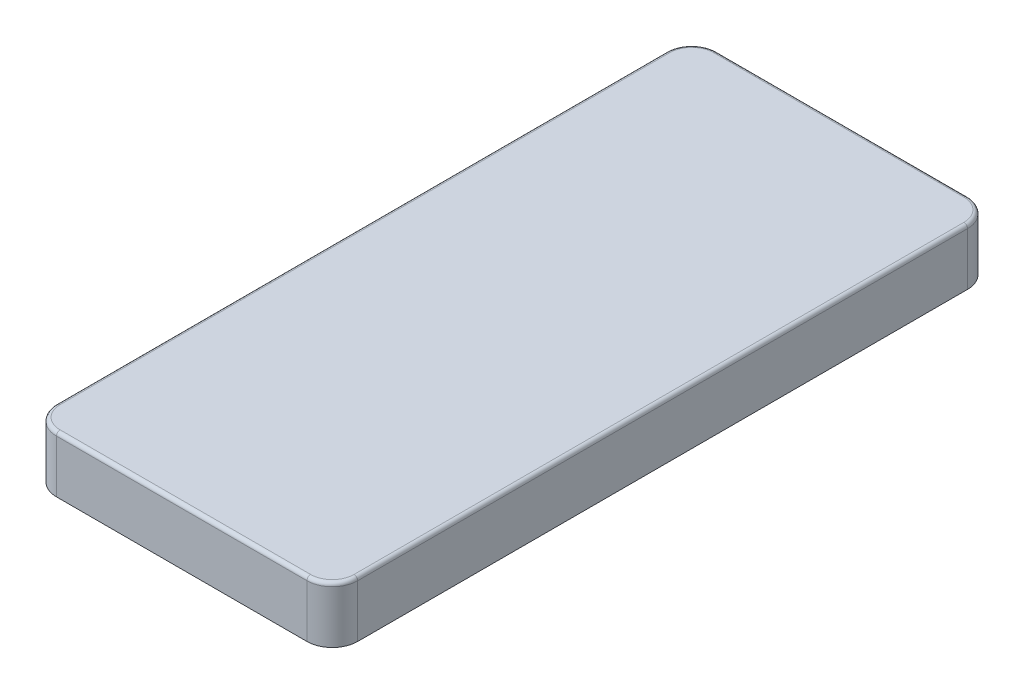
ISO-10303-21;
HEADER;
FILE_DESCRIPTION(('STEP AP214'),'2;1');
FILE_NAME('part.step','',(''),(''),'','','');
FILE_SCHEMA(('AUTOMOTIVE_DESIGN { 1 0 10303 214 1 1 1 1 }'));
ENDSEC;
DATA;
#1=APPLICATION_CONTEXT('core data for automotive mechanical design processes');
#2=APPLICATION_PROTOCOL_DEFINITION('international standard','automotive_design',2000,#1);
#3=PRODUCT_CONTEXT('',#1,'mechanical');
#4=PRODUCT('Part','Part','',(#3));
#5=PRODUCT_RELATED_PRODUCT_CATEGORY('part','',(#4));
#6=PRODUCT_DEFINITION_FORMATION('','',#4);
#7=PRODUCT_DEFINITION_CONTEXT('part definition',#1,'design');
#8=PRODUCT_DEFINITION('design','',#6,#7);
#9=PRODUCT_DEFINITION_SHAPE('','',#8);
#10=(LENGTH_UNIT() NAMED_UNIT(*) SI_UNIT(.MILLI.,.METRE.));
#11=(NAMED_UNIT(*) PLANE_ANGLE_UNIT() SI_UNIT($,.RADIAN.));
#12=(NAMED_UNIT(*) SI_UNIT($,.STERADIAN.) SOLID_ANGLE_UNIT());
#13=UNCERTAINTY_MEASURE_WITH_UNIT(LENGTH_MEASURE(1.E-05),#10,'distance_accuracy_value','');
#14=(GEOMETRIC_REPRESENTATION_CONTEXT(3) GLOBAL_UNCERTAINTY_ASSIGNED_CONTEXT((#13)) GLOBAL_UNIT_ASSIGNED_CONTEXT((#10,
#11,#12)) REPRESENTATION_CONTEXT('',''));
#15=CARTESIAN_POINT('',(0.,0.,0.));
#16=DIRECTION('',(0.,0.,1.));
#17=DIRECTION('',(1.,0.,0.));
#18=AXIS2_PLACEMENT_3D('',#15,#16,#17);
#19=CARTESIAN_POINT('',(-7.,15.5,-7.));
#20=DIRECTION('',(0.,-1.,0.));
#21=DIRECTION('',(0.,0.,-1.));
#22=AXIS2_PLACEMENT_3D('',#19,#20,#21);
#23=CYLINDRICAL_SURFACE('',#22,7.);
#24=DIRECTION('',(0.,-1.,0.));
#25=VECTOR('',#24,1.);
#26=CARTESIAN_POINT('',(0.,15.5,-7.00000000000005));
#27=LINE('',#26,#25);
#28=CARTESIAN_POINT('',(0.,14.5,-7.00000000000005));
#29=VERTEX_POINT('',#28);
#30=CARTESIAN_POINT('',(0.,0.,-7.00000000000005));
#31=VERTEX_POINT('',#30);
#32=EDGE_CURVE('E325',#29,#31,#27,.T.);
#33=ORIENTED_EDGE('',*,*,#32,.F.);
#34=CARTESIAN_POINT('',(-7.,14.5,-7.));
#35=DIRECTION('',(0.,1.,0.));
#36=DIRECTION('',(0.,0.,1.));
#37=AXIS2_PLACEMENT_3D('',#34,#35,#36);
#38=CIRCLE('',#37,7.);
#39=CARTESIAN_POINT('',(-7.00000000000005,14.5,0.));
#40=VERTEX_POINT('',#39);
#41=EDGE_CURVE('E353',#29,#40,#38,.F.);
#42=ORIENTED_EDGE('',*,*,#41,.T.);
#43=DIRECTION('',(0.,-1.,0.));
#44=VECTOR('',#43,1.);
#45=CARTESIAN_POINT('',(-7.00000000000005,15.5,0.));
#46=LINE('',#45,#44);
#47=CARTESIAN_POINT('',(-7.00000000000005,0.,0.));
#48=VERTEX_POINT('',#47);
#49=EDGE_CURVE('E304',#40,#48,#46,.T.);
#50=ORIENTED_EDGE('',*,*,#49,.T.);
#51=CARTESIAN_POINT('',(-7.,0.,-7.));
#52=DIRECTION('',(0.,1.,0.));
#53=DIRECTION('',(0.,0.,1.));
#54=AXIS2_PLACEMENT_3D('',#51,#52,#53);
#55=CIRCLE('',#54,7.);
#56=EDGE_CURVE('E205',#48,#31,#55,.T.);
#57=ORIENTED_EDGE('',*,*,#56,.T.);
#58=EDGE_LOOP('',(#33,#42,#50,#57));
#59=FACE_BOUND('',#58,.T.);
#60=ADVANCED_FACE('F38',(#59),#23,.T.);
#61=CARTESIAN_POINT('',(0.,15.5,-7.00000000000005));
#62=DIRECTION('',(-1.,0.,0.));
#63=DIRECTION('',(0.,0.,1.));
#64=AXIS2_PLACEMENT_3D('',#61,#62,#63);
#65=PLANE('',#64);
#66=DIRECTION('',(0.,-1.,0.));
#67=VECTOR('',#66,1.);
#68=CARTESIAN_POINT('',(0.,15.5,-175.));
#69=LINE('',#68,#67);
#70=CARTESIAN_POINT('',(0.,14.5,-175.));
#71=VERTEX_POINT('',#70);
#72=CARTESIAN_POINT('',(0.,0.,-175.));
#73=VERTEX_POINT('',#72);
#74=EDGE_CURVE('E322',#71,#73,#69,.T.);
#75=ORIENTED_EDGE('',*,*,#74,.F.);
#76=DIRECTION('',(0.,0.,-1.));
#77=VECTOR('',#76,1.);
#78=CARTESIAN_POINT('',(0.,14.5,-7.00000000000005));
#79=LINE('',#78,#77);
#80=EDGE_CURVE('E11',#71,#29,#79,.F.);
#81=ORIENTED_EDGE('',*,*,#80,.T.);
#82=ORIENTED_EDGE('',*,*,#32,.T.);
#83=DIRECTION('',(0.,0.,-1.));
#84=VECTOR('',#83,1.);
#85=CARTESIAN_POINT('',(0.,0.,-7.00000000000005));
#86=LINE('',#85,#84);
#87=EDGE_CURVE('E211',#31,#73,#86,.T.);
#88=ORIENTED_EDGE('',*,*,#87,.T.);
#89=EDGE_LOOP('',(#75,#81,#82,#88));
#90=FACE_BOUND('',#89,.T.);
#91=ADVANCED_FACE('F456',(#90),#65,.F.);
#92=CARTESIAN_POINT('',(-7.,15.5,-175.));
#93=DIRECTION('',(0.,-1.,0.));
#94=DIRECTION('',(0.,0.,-1.));
#95=AXIS2_PLACEMENT_3D('',#92,#93,#94);
#96=CYLINDRICAL_SURFACE('',#95,7.);
#97=DIRECTION('',(0.,-1.,0.));
#98=VECTOR('',#97,1.);
#99=CARTESIAN_POINT('',(-7.00000000000005,15.5,-182.));
#100=LINE('',#99,#98);
#101=CARTESIAN_POINT('',(-7.00000000000005,14.5,-182.));
#102=VERTEX_POINT('',#101);
#103=CARTESIAN_POINT('',(-7.00000000000005,0.,-182.));
#104=VERTEX_POINT('',#103);
#105=EDGE_CURVE('E319',#102,#104,#100,.T.);
#106=ORIENTED_EDGE('',*,*,#105,.F.);
#107=CARTESIAN_POINT('',(-7.,14.5,-175.));
#108=DIRECTION('',(0.,1.,0.));
#109=DIRECTION('',(0.,0.,1.));
#110=AXIS2_PLACEMENT_3D('',#107,#108,#109);
#111=CIRCLE('',#110,7.);
#112=EDGE_CURVE('E48',#102,#71,#111,.F.);
#113=ORIENTED_EDGE('',*,*,#112,.T.);
#114=ORIENTED_EDGE('',*,*,#74,.T.);
#115=CARTESIAN_POINT('',(-7.,0.,-175.));
#116=DIRECTION('',(0.,1.,0.));
#117=DIRECTION('',(0.,0.,1.));
#118=AXIS2_PLACEMENT_3D('',#115,#116,#117);
#119=CIRCLE('',#118,7.);
#120=EDGE_CURVE('E280',#73,#104,#119,.T.);
#121=ORIENTED_EDGE('',*,*,#120,.T.);
#122=EDGE_LOOP('',(#106,#113,#114,#121));
#123=FACE_BOUND('',#122,.T.);
#124=ADVANCED_FACE('F475',(#123),#96,.T.);
#125=CARTESIAN_POINT('',(-7.00000000000005,15.5,-182.));
#126=DIRECTION('',(0.,0.,1.));
#127=DIRECTION('',(1.,0.,0.));
#128=AXIS2_PLACEMENT_3D('',#125,#126,#127);
#129=PLANE('',#128);
#130=DIRECTION('',(0.,-1.,0.));
#131=VECTOR('',#130,1.);
#132=CARTESIAN_POINT('',(-76.,15.5,-182.));
#133=LINE('',#132,#131);
#134=CARTESIAN_POINT('',(-76.,14.5,-182.));
#135=VERTEX_POINT('',#134);
#136=CARTESIAN_POINT('',(-76.,0.,-182.));
#137=VERTEX_POINT('',#136);
#138=EDGE_CURVE('E316',#135,#137,#133,.T.);
#139=ORIENTED_EDGE('',*,*,#138,.F.);
#140=DIRECTION('',(-1.,0.,0.));
#141=VECTOR('',#140,1.);
#142=CARTESIAN_POINT('',(-7.00000000000005,14.5,-182.));
#143=LINE('',#142,#141);
#144=EDGE_CURVE('E63',#135,#102,#143,.F.);
#145=ORIENTED_EDGE('',*,*,#144,.T.);
#146=ORIENTED_EDGE('',*,*,#105,.T.);
#147=DIRECTION('',(-1.,0.,0.));
#148=VECTOR('',#147,1.);
#149=CARTESIAN_POINT('',(-7.00000000000005,0.,-182.));
#150=LINE('',#149,#148);
#151=EDGE_CURVE('E284',#104,#137,#150,.T.);
#152=ORIENTED_EDGE('',*,*,#151,.T.);
#153=EDGE_LOOP('',(#139,#145,#146,#152));
#154=FACE_BOUND('',#153,.T.);
#155=ADVANCED_FACE('F414',(#154),#129,.F.);
#156=CARTESIAN_POINT('',(-76.,15.5,-175.));
#157=DIRECTION('',(0.,-1.,0.));
#158=DIRECTION('',(0.,0.,-1.));
#159=AXIS2_PLACEMENT_3D('',#156,#157,#158);
#160=CYLINDRICAL_SURFACE('',#159,7.00000000000001);
#161=DIRECTION('',(0.,-1.,0.));
#162=VECTOR('',#161,1.);
#163=CARTESIAN_POINT('',(-83.,15.5,-175.));
#164=LINE('',#163,#162);
#165=CARTESIAN_POINT('',(-83.,14.5,-175.));
#166=VERTEX_POINT('',#165);
#167=CARTESIAN_POINT('',(-83.,0.,-175.));
#168=VERTEX_POINT('',#167);
#169=EDGE_CURVE('E313',#166,#168,#164,.T.);
#170=ORIENTED_EDGE('',*,*,#169,.F.);
#171=CARTESIAN_POINT('',(-76.,14.5,-175.));
#172=DIRECTION('',(0.,1.,0.));
#173=DIRECTION('',(0.,0.,1.));
#174=AXIS2_PLACEMENT_3D('',#171,#172,#173);
#175=CIRCLE('',#174,7.00000000000001);
#176=EDGE_CURVE('E366',#166,#135,#175,.F.);
#177=ORIENTED_EDGE('',*,*,#176,.T.);
#178=ORIENTED_EDGE('',*,*,#138,.T.);
#179=CARTESIAN_POINT('',(-76.,0.,-175.));
#180=DIRECTION('',(0.,1.,0.));
#181=DIRECTION('',(0.,0.,1.));
#182=AXIS2_PLACEMENT_3D('',#179,#180,#181);
#183=CIRCLE('',#182,7.00000000000001);
#184=EDGE_CURVE('E288',#137,#168,#183,.T.);
#185=ORIENTED_EDGE('',*,*,#184,.T.);
#186=EDGE_LOOP('',(#170,#177,#178,#185));
#187=FACE_BOUND('',#186,.T.);
#188=ADVANCED_FACE('F413',(#187),#160,.T.);
#189=CARTESIAN_POINT('',(-83.,15.5,-7.00000000000004));
#190=DIRECTION('',(1.,0.,0.));
#191=DIRECTION('',(0.,0.,-1.));
#192=AXIS2_PLACEMENT_3D('',#189,#190,#191);
#193=PLANE('',#192);
#194=DIRECTION('',(0.,-1.,0.));
#195=VECTOR('',#194,1.);
#196=CARTESIAN_POINT('',(-83.,15.5,-7.00000000000004));
#197=LINE('',#196,#195);
#198=CARTESIAN_POINT('',(-83.,14.5,-7.00000000000004));
#199=VERTEX_POINT('',#198);
#200=CARTESIAN_POINT('',(-83.,0.,-7.00000000000004));
#201=VERTEX_POINT('',#200);
#202=EDGE_CURVE('E310',#199,#201,#197,.T.);
#203=ORIENTED_EDGE('',*,*,#202,.F.);
#204=DIRECTION('',(0.,0.,1.));
#205=VECTOR('',#204,1.);
#206=CARTESIAN_POINT('',(-83.,14.5,-175.));
#207=LINE('',#206,#205);
#208=EDGE_CURVE('E363',#199,#166,#207,.F.);
#209=ORIENTED_EDGE('',*,*,#208,.T.);
#210=ORIENTED_EDGE('',*,*,#169,.T.);
#211=DIRECTION('',(0.,0.,1.));
#212=VECTOR('',#211,1.);
#213=CARTESIAN_POINT('',(-83.,0.,-7.00000000000004));
#214=LINE('',#213,#212);
#215=EDGE_CURVE('E292',#168,#201,#214,.T.);
#216=ORIENTED_EDGE('',*,*,#215,.T.);
#217=EDGE_LOOP('',(#203,#209,#210,#216));
#218=FACE_BOUND('',#217,.T.);
#219=ADVANCED_FACE('F426',(#218),#193,.F.);
#220=CARTESIAN_POINT('',(-76.,15.5,-6.99999999999999));
#221=DIRECTION('',(0.,-1.,0.));
#222=DIRECTION('',(0.,0.,-1.));
#223=AXIS2_PLACEMENT_3D('',#220,#221,#222);
#224=CYLINDRICAL_SURFACE('',#223,7.);
#225=DIRECTION('',(0.,-1.,0.));
#226=VECTOR('',#225,1.);
#227=CARTESIAN_POINT('',(-76.,15.5,0.));
#228=LINE('',#227,#226);
#229=CARTESIAN_POINT('',(-76.,14.5,0.));
#230=VERTEX_POINT('',#229);
#231=CARTESIAN_POINT('',(-76.,0.,0.));
#232=VERTEX_POINT('',#231);
#233=EDGE_CURVE('E307',#230,#232,#228,.T.);
#234=ORIENTED_EDGE('',*,*,#233,.F.);
#235=CARTESIAN_POINT('',(-76.,14.5,-6.99999999999999));
#236=DIRECTION('',(0.,1.,0.));
#237=DIRECTION('',(0.,0.,1.));
#238=AXIS2_PLACEMENT_3D('',#235,#236,#237);
#239=CIRCLE('',#238,7.);
#240=EDGE_CURVE('E360',#230,#199,#239,.F.);
#241=ORIENTED_EDGE('',*,*,#240,.T.);
#242=ORIENTED_EDGE('',*,*,#202,.T.);
#243=CARTESIAN_POINT('',(-76.,0.,-6.99999999999999));
#244=DIRECTION('',(0.,1.,0.));
#245=DIRECTION('',(0.,0.,-1.));
#246=AXIS2_PLACEMENT_3D('',#243,#244,#245);
#247=CIRCLE('',#246,7.);
#248=EDGE_CURVE('E296',#201,#232,#247,.T.);
#249=ORIENTED_EDGE('',*,*,#248,.T.);
#250=EDGE_LOOP('',(#234,#241,#242,#249));
#251=FACE_BOUND('',#250,.T.);
#252=ADVANCED_FACE('F429',(#251),#224,.T.);
#253=CARTESIAN_POINT('',(-7.00000000000005,15.5,0.));
#254=DIRECTION('',(0.,0.,-1.));
#255=DIRECTION('',(-1.,0.,0.));
#256=AXIS2_PLACEMENT_3D('',#253,#254,#255);
#257=PLANE('',#256);
#258=ORIENTED_EDGE('',*,*,#49,.F.);
#259=DIRECTION('',(1.,0.,0.));
#260=VECTOR('',#259,1.);
#261=CARTESIAN_POINT('',(-76.,14.5,0.));
#262=LINE('',#261,#260);
#263=EDGE_CURVE('E357',#40,#230,#262,.F.);
#264=ORIENTED_EDGE('',*,*,#263,.T.);
#265=ORIENTED_EDGE('',*,*,#233,.T.);
#266=DIRECTION('',(1.,0.,0.));
#267=VECTOR('',#266,1.);
#268=CARTESIAN_POINT('',(-7.00000000000005,0.,0.));
#269=LINE('',#268,#267);
#270=EDGE_CURVE('E300',#232,#48,#269,.T.);
#271=ORIENTED_EDGE('',*,*,#270,.T.);
#272=EDGE_LOOP('',(#258,#264,#265,#271));
#273=FACE_BOUND('',#272,.T.);
#274=ADVANCED_FACE('F488',(#273),#257,.F.);
#275=CARTESIAN_POINT('',(-7.,15.5,-7.));
#276=DIRECTION('',(0.,1.,0.));
#277=DIRECTION('',(0.,0.,1.));
#278=AXIS2_PLACEMENT_3D('',#275,#276,#277);
#279=PLANE('',#278);
#280=DIRECTION('',(1.,0.,0.));
#281=VECTOR('',#280,1.);
#282=CARTESIAN_POINT('',(-7.00000000000005,15.5,-0.999999999999999));
#283=LINE('',#282,#281);
#284=CARTESIAN_POINT('',(-76.,15.5,-0.999999999999994));
#285=VERTEX_POINT('',#284);
#286=CARTESIAN_POINT('',(-7.00000000000004,15.5,-0.999999999999999));
#287=VERTEX_POINT('',#286);
#288=EDGE_CURVE('E346',#285,#287,#283,.T.);
#289=ORIENTED_EDGE('',*,*,#288,.T.);
#290=CARTESIAN_POINT('',(-7.,15.5,-7.));
#291=DIRECTION('',(0.,1.,0.));
#292=DIRECTION('',(0.,0.,1.));
#293=AXIS2_PLACEMENT_3D('',#290,#291,#292);
#294=CIRCLE('',#293,6.);
#295=CARTESIAN_POINT('',(-1.,15.5,-7.00000000000004));
#296=VERTEX_POINT('',#295);
#297=EDGE_CURVE('E349',#287,#296,#294,.T.);
#298=ORIENTED_EDGE('',*,*,#297,.T.);
#299=DIRECTION('',(0.,0.,-1.));
#300=VECTOR('',#299,1.);
#301=CARTESIAN_POINT('',(-1.,15.5,-175.));
#302=LINE('',#301,#300);
#303=CARTESIAN_POINT('',(-1.,15.5,-175.));
#304=VERTEX_POINT('',#303);
#305=EDGE_CURVE('E328',#296,#304,#302,.T.);
#306=ORIENTED_EDGE('',*,*,#305,.T.);
#307=CARTESIAN_POINT('',(-7.,15.5,-175.));
#308=DIRECTION('',(0.,1.,0.));
#309=DIRECTION('',(0.,0.,1.));
#310=AXIS2_PLACEMENT_3D('',#307,#308,#309);
#311=CIRCLE('',#310,6.);
#312=CARTESIAN_POINT('',(-7.00000000000005,15.5,-181.));
#313=VERTEX_POINT('',#312);
#314=EDGE_CURVE('E331',#304,#313,#311,.T.);
#315=ORIENTED_EDGE('',*,*,#314,.T.);
#316=DIRECTION('',(-1.,0.,0.));
#317=VECTOR('',#316,1.);
#318=CARTESIAN_POINT('',(-76.,15.5,-181.));
#319=LINE('',#318,#317);
#320=CARTESIAN_POINT('',(-76.,15.5,-181.));
#321=VERTEX_POINT('',#320);
#322=EDGE_CURVE('E334',#313,#321,#319,.T.);
#323=ORIENTED_EDGE('',*,*,#322,.T.);
#324=CARTESIAN_POINT('',(-76.,15.5,-175.));
#325=DIRECTION('',(0.,1.,0.));
#326=DIRECTION('',(0.,0.,1.));
#327=AXIS2_PLACEMENT_3D('',#324,#325,#326);
#328=CIRCLE('',#327,6.00000000000001);
#329=CARTESIAN_POINT('',(-82.,15.5,-175.));
#330=VERTEX_POINT('',#329);
#331=EDGE_CURVE('E337',#321,#330,#328,.T.);
#332=ORIENTED_EDGE('',*,*,#331,.T.);
#333=DIRECTION('',(0.,0.,1.));
#334=VECTOR('',#333,1.);
#335=CARTESIAN_POINT('',(-82.,15.5,-7.00000000000004));
#336=LINE('',#335,#334);
#337=CARTESIAN_POINT('',(-82.,15.5,-7.00000000000003));
#338=VERTEX_POINT('',#337);
#339=EDGE_CURVE('E340',#330,#338,#336,.T.);
#340=ORIENTED_EDGE('',*,*,#339,.T.);
#341=CARTESIAN_POINT('',(-76.,15.5,-6.99999999999999));
#342=DIRECTION('',(0.,1.,0.));
#343=DIRECTION('',(0.,0.,1.));
#344=AXIS2_PLACEMENT_3D('',#341,#342,#343);
#345=CIRCLE('',#344,6.);
#346=EDGE_CURVE('E343',#338,#285,#345,.T.);
#347=ORIENTED_EDGE('',*,*,#346,.T.);
#348=EDGE_LOOP('',(#289,#298,#306,#315,#323,#332,#340,#347));
#349=FACE_BOUND('',#348,.T.);
#350=ADVANCED_FACE('F442',(#349),#279,.T.);
#351=CARTESIAN_POINT('',(-7.,0.,-7.));
#352=DIRECTION('',(0.,1.,0.));
#353=DIRECTION('',(0.,0.,1.));
#354=AXIS2_PLACEMENT_3D('',#351,#352,#353);
#355=PLANE('',#354);
#356=DIRECTION('',(1.,0.,0.));
#357=VECTOR('',#356,1.);
#358=CARTESIAN_POINT('',(-7.00000000000005,0.,-2.));
#359=LINE('',#358,#357);
#360=CARTESIAN_POINT('',(-76.,0.,-1.99999999999999));
#361=VERTEX_POINT('',#360);
#362=CARTESIAN_POINT('',(-7.00000000000005,0.,-2.));
#363=VERTEX_POINT('',#362);
#364=EDGE_CURVE('E199',#361,#363,#359,.T.);
#365=ORIENTED_EDGE('',*,*,#364,.T.);
#366=CARTESIAN_POINT('',(-7.,0.,-7.));
#367=DIRECTION('',(0.,1.,0.));
#368=DIRECTION('',(0.,0.,1.));
#369=AXIS2_PLACEMENT_3D('',#366,#367,#368);
#370=CIRCLE('',#369,5.);
#371=CARTESIAN_POINT('',(-2.,0.,-7.00000000000005));
#372=VERTEX_POINT('',#371);
#373=EDGE_CURVE('E249',#363,#372,#370,.T.);
#374=ORIENTED_EDGE('',*,*,#373,.T.);
#375=DIRECTION('',(0.,0.,-1.));
#376=VECTOR('',#375,1.);
#377=CARTESIAN_POINT('',(-2.,0.,-7.00000000000005));
#378=LINE('',#377,#376);
#379=CARTESIAN_POINT('',(-2.,0.,-175.));
#380=VERTEX_POINT('',#379);
#381=EDGE_CURVE('E203',#372,#380,#378,.T.);
#382=ORIENTED_EDGE('',*,*,#381,.T.);
#383=CARTESIAN_POINT('',(-7.,0.,-175.));
#384=DIRECTION('',(0.,1.,0.));
#385=DIRECTION('',(0.,0.,1.));
#386=AXIS2_PLACEMENT_3D('',#383,#384,#385);
#387=CIRCLE('',#386,5.);
#388=CARTESIAN_POINT('',(-7.00000000000003,0.,-180.));
#389=VERTEX_POINT('',#388);
#390=EDGE_CURVE('E271',#380,#389,#387,.T.);
#391=ORIENTED_EDGE('',*,*,#390,.T.);
#392=DIRECTION('',(-1.,0.,0.));
#393=VECTOR('',#392,1.);
#394=CARTESIAN_POINT('',(-7.00000000000005,0.,-180.));
#395=LINE('',#394,#393);
#396=CARTESIAN_POINT('',(-76.,0.,-180.));
#397=VERTEX_POINT('',#396);
#398=EDGE_CURVE('E267',#389,#397,#395,.T.);
#399=ORIENTED_EDGE('',*,*,#398,.T.);
#400=CARTESIAN_POINT('',(-76.,0.,-175.));
#401=DIRECTION('',(0.,1.,0.));
#402=DIRECTION('',(0.,0.,1.));
#403=AXIS2_PLACEMENT_3D('',#400,#401,#402);
#404=CIRCLE('',#403,5.00000000000001);
#405=CARTESIAN_POINT('',(-81.,0.,-175.));
#406=VERTEX_POINT('',#405);
#407=EDGE_CURVE('E263',#397,#406,#404,.T.);
#408=ORIENTED_EDGE('',*,*,#407,.T.);
#409=DIRECTION('',(0.,0.,1.));
#410=VECTOR('',#409,1.);
#411=CARTESIAN_POINT('',(-81.,0.,-7.00000000000004));
#412=LINE('',#411,#410);
#413=CARTESIAN_POINT('',(-81.,0.,-7.00000000000004));
#414=VERTEX_POINT('',#413);
#415=EDGE_CURVE('E259',#406,#414,#412,.T.);
#416=ORIENTED_EDGE('',*,*,#415,.T.);
#417=CARTESIAN_POINT('',(-76.,0.,-6.99999999999999));
#418=DIRECTION('',(0.,1.,0.));
#419=DIRECTION('',(0.,0.,1.));
#420=AXIS2_PLACEMENT_3D('',#417,#418,#419);
#421=CIRCLE('',#420,5.);
#422=EDGE_CURVE('E255',#414,#361,#421,.T.);
#423=ORIENTED_EDGE('',*,*,#422,.T.);
#424=EDGE_LOOP('',(#365,#374,#382,#391,#399,#408,#416,#423));
#425=FACE_BOUND('',#424,.T.);
#426=ORIENTED_EDGE('',*,*,#56,.F.);
#427=ORIENTED_EDGE('',*,*,#270,.F.);
#428=ORIENTED_EDGE('',*,*,#248,.F.);
#429=ORIENTED_EDGE('',*,*,#215,.F.);
#430=ORIENTED_EDGE('',*,*,#184,.F.);
#431=ORIENTED_EDGE('',*,*,#151,.F.);
#432=ORIENTED_EDGE('',*,*,#120,.F.);
#433=ORIENTED_EDGE('',*,*,#87,.F.);
#434=EDGE_LOOP('',(#426,#427,#428,#429,#430,#431,#432,#433));
#435=FACE_BOUND('',#434,.T.);
#436=ADVANCED_FACE('F421',(#425,#435),#355,.F.);
#437=CARTESIAN_POINT('',(-7.,15.5,-7.));
#438=DIRECTION('',(0.,-1.,0.));
#439=DIRECTION('',(0.,0.,-1.));
#440=AXIS2_PLACEMENT_3D('',#437,#438,#439);
#441=CYLINDRICAL_SURFACE('',#440,5.);
#442=ORIENTED_EDGE('',*,*,#373,.F.);
#443=DIRECTION('',(0.,-1.,0.));
#444=VECTOR('',#443,1.);
#445=CARTESIAN_POINT('',(-7.00000000000003,15.5,-2.));
#446=LINE('',#445,#444);
#447=CARTESIAN_POINT('',(-7.00000000000003,13.5,-2.));
#448=VERTEX_POINT('',#447);
#449=EDGE_CURVE('E197',#448,#363,#446,.T.);
#450=ORIENTED_EDGE('',*,*,#449,.F.);
#451=CARTESIAN_POINT('',(-7.,13.5,-7.));
#452=DIRECTION('',(0.,1.,0.));
#453=DIRECTION('',(0.,0.,1.));
#454=AXIS2_PLACEMENT_3D('',#451,#452,#453);
#455=CIRCLE('',#454,5.);
#456=CARTESIAN_POINT('',(-2.,13.5,-7.00000000000005));
#457=VERTEX_POINT('',#456);
#458=EDGE_CURVE('E181',#448,#457,#455,.T.);
#459=ORIENTED_EDGE('',*,*,#458,.T.);
#460=DIRECTION('',(0.,1.,0.));
#461=VECTOR('',#460,1.);
#462=CARTESIAN_POINT('',(-2.,15.5,-7.00000000000005));
#463=LINE('',#462,#461);
#464=EDGE_CURVE('E195',#457,#372,#463,.F.);
#465=ORIENTED_EDGE('',*,*,#464,.T.);
#466=EDGE_LOOP('',(#442,#450,#459,#465));
#467=FACE_BOUND('',#466,.T.);
#468=ADVANCED_FACE('F194',(#467),#441,.F.);
#469=CARTESIAN_POINT('',(-2.,15.5,-7.00000000000005));
#470=DIRECTION('',(-1.,0.,0.));
#471=DIRECTION('',(0.,0.,1.));
#472=AXIS2_PLACEMENT_3D('',#469,#470,#471);
#473=PLANE('',#472);
#474=ORIENTED_EDGE('',*,*,#381,.F.);
#475=ORIENTED_EDGE('',*,*,#464,.F.);
#476=DIRECTION('',(0.,0.,-1.));
#477=VECTOR('',#476,1.);
#478=CARTESIAN_POINT('',(-2.,13.5,-7.00000000000005));
#479=LINE('',#478,#477);
#480=CARTESIAN_POINT('',(-2.,13.5,-175.));
#481=VERTEX_POINT('',#480);
#482=EDGE_CURVE('E177',#457,#481,#479,.T.);
#483=ORIENTED_EDGE('',*,*,#482,.T.);
#484=DIRECTION('',(0.,-1.,0.));
#485=VECTOR('',#484,1.);
#486=CARTESIAN_POINT('',(-2.,15.5,-175.));
#487=LINE('',#486,#485);
#488=EDGE_CURVE('E206',#481,#380,#487,.T.);
#489=ORIENTED_EDGE('',*,*,#488,.T.);
#490=EDGE_LOOP('',(#474,#475,#483,#489));
#491=FACE_BOUND('',#490,.T.);
#492=ADVANCED_FACE('F201',(#491),#473,.T.);
#493=CARTESIAN_POINT('',(-7.,15.5,-175.));
#494=DIRECTION('',(0.,-1.,0.));
#495=DIRECTION('',(0.,0.,-1.));
#496=AXIS2_PLACEMENT_3D('',#493,#494,#495);
#497=CYLINDRICAL_SURFACE('',#496,5.);
#498=ORIENTED_EDGE('',*,*,#390,.F.);
#499=ORIENTED_EDGE('',*,*,#488,.F.);
#500=CARTESIAN_POINT('',(-7.,13.5,-175.));
#501=DIRECTION('',(0.,1.,0.));
#502=DIRECTION('',(0.,0.,1.));
#503=AXIS2_PLACEMENT_3D('',#500,#501,#502);
#504=CIRCLE('',#503,5.);
#505=CARTESIAN_POINT('',(-7.00000000000005,13.5,-180.));
#506=VERTEX_POINT('',#505);
#507=EDGE_CURVE('E183',#481,#506,#504,.T.);
#508=ORIENTED_EDGE('',*,*,#507,.T.);
#509=DIRECTION('',(0.,1.,0.));
#510=VECTOR('',#509,1.);
#511=CARTESIAN_POINT('',(-7.00000000000005,15.5,-180.));
#512=LINE('',#511,#510);
#513=EDGE_CURVE('E213',#506,#389,#512,.F.);
#514=ORIENTED_EDGE('',*,*,#513,.T.);
#515=EDGE_LOOP('',(#498,#499,#508,#514));
#516=FACE_BOUND('',#515,.T.);
#517=ADVANCED_FACE('F517',(#516),#497,.F.);
#518=CARTESIAN_POINT('',(-7.00000000000005,15.5,-180.));
#519=DIRECTION('',(0.,0.,1.));
#520=DIRECTION('',(1.,0.,0.));
#521=AXIS2_PLACEMENT_3D('',#518,#519,#520);
#522=PLANE('',#521);
#523=ORIENTED_EDGE('',*,*,#398,.F.);
#524=ORIENTED_EDGE('',*,*,#513,.F.);
#525=DIRECTION('',(-1.,0.,0.));
#526=VECTOR('',#525,1.);
#527=CARTESIAN_POINT('',(-7.00000000000005,13.5,-180.));
#528=LINE('',#527,#526);
#529=CARTESIAN_POINT('',(-76.,13.5,-180.));
#530=VERTEX_POINT('',#529);
#531=EDGE_CURVE('E225',#506,#530,#528,.T.);
#532=ORIENTED_EDGE('',*,*,#531,.T.);
#533=DIRECTION('',(0.,-1.,0.));
#534=VECTOR('',#533,1.);
#535=CARTESIAN_POINT('',(-76.,15.5,-180.));
#536=LINE('',#535,#534);
#537=EDGE_CURVE('E222',#530,#397,#536,.T.);
#538=ORIENTED_EDGE('',*,*,#537,.T.);
#539=EDGE_LOOP('',(#523,#524,#532,#538));
#540=FACE_BOUND('',#539,.T.);
#541=ADVANCED_FACE('F513',(#540),#522,.T.);
#542=CARTESIAN_POINT('',(-76.,15.5,-175.));
#543=DIRECTION('',(0.,-1.,0.));
#544=DIRECTION('',(0.,0.,-1.));
#545=AXIS2_PLACEMENT_3D('',#542,#543,#544);
#546=CYLINDRICAL_SURFACE('',#545,5.00000000000001);
#547=ORIENTED_EDGE('',*,*,#407,.F.);
#548=ORIENTED_EDGE('',*,*,#537,.F.);
#549=CARTESIAN_POINT('',(-76.,13.5,-175.));
#550=DIRECTION('',(0.,1.,0.));
#551=DIRECTION('',(0.,0.,1.));
#552=AXIS2_PLACEMENT_3D('',#549,#550,#551);
#553=CIRCLE('',#552,5.00000000000001);
#554=CARTESIAN_POINT('',(-81.,13.5,-175.));
#555=VERTEX_POINT('',#554);
#556=EDGE_CURVE('E231',#530,#555,#553,.T.);
#557=ORIENTED_EDGE('',*,*,#556,.T.);
#558=DIRECTION('',(0.,1.,0.));
#559=VECTOR('',#558,1.);
#560=CARTESIAN_POINT('',(-81.,15.5,-175.));
#561=LINE('',#560,#559);
#562=EDGE_CURVE('E228',#555,#406,#561,.F.);
#563=ORIENTED_EDGE('',*,*,#562,.T.);
#564=EDGE_LOOP('',(#547,#548,#557,#563));
#565=FACE_BOUND('',#564,.T.);
#566=ADVANCED_FACE('F509',(#565),#546,.F.);
#567=CARTESIAN_POINT('',(-81.,15.5,-7.00000000000004));
#568=DIRECTION('',(1.,0.,0.));
#569=DIRECTION('',(0.,0.,-1.));
#570=AXIS2_PLACEMENT_3D('',#567,#568,#569);
#571=PLANE('',#570);
#572=ORIENTED_EDGE('',*,*,#415,.F.);
#573=ORIENTED_EDGE('',*,*,#562,.F.);
#574=DIRECTION('',(0.,0.,1.));
#575=VECTOR('',#574,1.);
#576=CARTESIAN_POINT('',(-81.,13.5,-7.00000000000004));
#577=LINE('',#576,#575);
#578=CARTESIAN_POINT('',(-81.,13.5,-7.00000000000002));
#579=VERTEX_POINT('',#578);
#580=EDGE_CURVE('E237',#555,#579,#577,.T.);
#581=ORIENTED_EDGE('',*,*,#580,.T.);
#582=DIRECTION('',(0.,-1.,0.));
#583=VECTOR('',#582,1.);
#584=CARTESIAN_POINT('',(-81.,15.5,-7.00000000000002));
#585=LINE('',#584,#583);
#586=EDGE_CURVE('E234',#579,#414,#585,.T.);
#587=ORIENTED_EDGE('',*,*,#586,.T.);
#588=EDGE_LOOP('',(#572,#573,#581,#587));
#589=FACE_BOUND('',#588,.T.);
#590=ADVANCED_FACE('F505',(#589),#571,.T.);
#591=CARTESIAN_POINT('',(-76.,15.5,-6.99999999999999));
#592=DIRECTION('',(0.,-1.,0.));
#593=DIRECTION('',(0.,0.,-1.));
#594=AXIS2_PLACEMENT_3D('',#591,#592,#593);
#595=CYLINDRICAL_SURFACE('',#594,5.);
#596=ORIENTED_EDGE('',*,*,#422,.F.);
#597=ORIENTED_EDGE('',*,*,#586,.F.);
#598=CARTESIAN_POINT('',(-76.,13.5,-6.99999999999999));
#599=DIRECTION('',(0.,1.,0.));
#600=DIRECTION('',(0.,0.,1.));
#601=AXIS2_PLACEMENT_3D('',#598,#599,#600);
#602=CIRCLE('',#601,5.);
#603=CARTESIAN_POINT('',(-76.,13.5,-1.99999999999999));
#604=VERTEX_POINT('',#603);
#605=EDGE_CURVE('E242',#579,#604,#602,.T.);
#606=ORIENTED_EDGE('',*,*,#605,.T.);
#607=DIRECTION('',(0.,1.,0.));
#608=VECTOR('',#607,1.);
#609=CARTESIAN_POINT('',(-76.,15.5,-1.99999999999999));
#610=LINE('',#609,#608);
#611=EDGE_CURVE('E217',#604,#361,#610,.F.);
#612=ORIENTED_EDGE('',*,*,#611,.T.);
#613=EDGE_LOOP('',(#596,#597,#606,#612));
#614=FACE_BOUND('',#613,.T.);
#615=ADVANCED_FACE('F501',(#614),#595,.F.);
#616=CARTESIAN_POINT('',(-7.00000000000005,15.5,-2.));
#617=DIRECTION('',(0.,0.,-1.));
#618=DIRECTION('',(-1.,0.,0.));
#619=AXIS2_PLACEMENT_3D('',#616,#617,#618);
#620=PLANE('',#619);
#621=ORIENTED_EDGE('',*,*,#364,.F.);
#622=ORIENTED_EDGE('',*,*,#611,.F.);
#623=DIRECTION('',(1.,0.,0.));
#624=VECTOR('',#623,1.);
#625=CARTESIAN_POINT('',(-7.00000000000005,13.5,-2.));
#626=LINE('',#625,#624);
#627=EDGE_CURVE('E218',#604,#448,#626,.T.);
#628=ORIENTED_EDGE('',*,*,#627,.T.);
#629=ORIENTED_EDGE('',*,*,#449,.T.);
#630=EDGE_LOOP('',(#621,#622,#628,#629));
#631=FACE_BOUND('',#630,.T.);
#632=ADVANCED_FACE('F498',(#631),#620,.T.);
#633=CARTESIAN_POINT('',(-7.,13.5,-7.));
#634=DIRECTION('',(0.,1.,0.));
#635=DIRECTION('',(0.,0.,1.));
#636=AXIS2_PLACEMENT_3D('',#633,#634,#635);
#637=PLANE('',#636);
#638=ORIENTED_EDGE('',*,*,#458,.F.);
#639=ORIENTED_EDGE('',*,*,#627,.F.);
#640=ORIENTED_EDGE('',*,*,#605,.F.);
#641=ORIENTED_EDGE('',*,*,#580,.F.);
#642=ORIENTED_EDGE('',*,*,#556,.F.);
#643=ORIENTED_EDGE('',*,*,#531,.F.);
#644=ORIENTED_EDGE('',*,*,#507,.F.);
#645=ORIENTED_EDGE('',*,*,#482,.F.);
#646=EDGE_LOOP('',(#638,#639,#640,#641,#642,#643,#644,#645));
#647=FACE_BOUND('',#646,.T.);
#648=ADVANCED_FACE('F179',(#647),#637,.F.);
#649=CARTESIAN_POINT('',(-76.,14.5,-175.));
#650=DIRECTION('',(0.,1.,0.));
#651=DIRECTION('',(0.,0.,1.));
#652=AXIS2_PLACEMENT_3D('',#649,#650,#651);
#653=TOROIDAL_SURFACE('',#652,6.00000000000001,1.);
#654=CARTESIAN_POINT('',(-76.,14.5,-181.));
#655=DIRECTION('',(1.,0.,0.));
#656=DIRECTION('',(0.,0.,-1.));
#657=AXIS2_PLACEMENT_3D('',#654,#655,#656);
#658=CIRCLE('',#657,1.);
#659=EDGE_CURVE('E394',#135,#321,#658,.T.);
#660=ORIENTED_EDGE('',*,*,#659,.F.);
#661=ORIENTED_EDGE('',*,*,#176,.F.);
#662=CARTESIAN_POINT('',(-82.,14.5,-175.));
#663=DIRECTION('',(0.,0.,1.));
#664=DIRECTION('',(1.,0.,0.));
#665=AXIS2_PLACEMENT_3D('',#662,#663,#664);
#666=CIRCLE('',#665,1.);
#667=EDGE_CURVE('E42',#330,#166,#666,.T.);
#668=ORIENTED_EDGE('',*,*,#667,.F.);
#669=ORIENTED_EDGE('',*,*,#331,.F.);
#670=EDGE_LOOP('',(#660,#661,#668,#669));
#671=FACE_BOUND('',#670,.T.);
#672=ADVANCED_FACE('F40',(#671),#653,.T.);
#673=CARTESIAN_POINT('',(-82.,14.5,-7.));
#674=DIRECTION('',(0.,0.,-1.));
#675=DIRECTION('',(-1.,0.,0.));
#676=AXIS2_PLACEMENT_3D('',#673,#674,#675);
#677=CYLINDRICAL_SURFACE('',#676,1.);
#678=ORIENTED_EDGE('',*,*,#667,.T.);
#679=ORIENTED_EDGE('',*,*,#208,.F.);
#680=CARTESIAN_POINT('',(-82.,14.5,-7.00000000000003));
#681=DIRECTION('',(0.,0.,1.));
#682=DIRECTION('',(1.,0.,0.));
#683=AXIS2_PLACEMENT_3D('',#680,#681,#682);
#684=CIRCLE('',#683,1.);
#685=EDGE_CURVE('E391',#338,#199,#684,.T.);
#686=ORIENTED_EDGE('',*,*,#685,.F.);
#687=ORIENTED_EDGE('',*,*,#339,.F.);
#688=EDGE_LOOP('',(#678,#679,#686,#687));
#689=FACE_BOUND('',#688,.T.);
#690=ADVANCED_FACE('F406',(#689),#677,.T.);
#691=CARTESIAN_POINT('',(-7.00000000000007,14.5,-181.));
#692=DIRECTION('',(1.,0.,0.));
#693=DIRECTION('',(0.,0.,-1.));
#694=AXIS2_PLACEMENT_3D('',#691,#692,#693);
#695=CYLINDRICAL_SURFACE('',#694,1.);
#696=ORIENTED_EDGE('',*,*,#659,.T.);
#697=ORIENTED_EDGE('',*,*,#322,.F.);
#698=CARTESIAN_POINT('',(-7.00000000000005,14.5,-181.));
#699=DIRECTION('',(1.,0.,0.));
#700=DIRECTION('',(0.,0.,-1.));
#701=AXIS2_PLACEMENT_3D('',#698,#699,#700);
#702=CIRCLE('',#701,1.);
#703=EDGE_CURVE('E387',#102,#313,#702,.T.);
#704=ORIENTED_EDGE('',*,*,#703,.F.);
#705=ORIENTED_EDGE('',*,*,#144,.F.);
#706=EDGE_LOOP('',(#696,#697,#704,#705));
#707=FACE_BOUND('',#706,.T.);
#708=ADVANCED_FACE('F445',(#707),#695,.T.);
#709=CARTESIAN_POINT('',(-76.,14.5,-6.99999999999999));
#710=DIRECTION('',(0.,1.,0.));
#711=DIRECTION('',(0.,0.,1.));
#712=AXIS2_PLACEMENT_3D('',#709,#710,#711);
#713=TOROIDAL_SURFACE('',#712,6.,1.);
#714=ORIENTED_EDGE('',*,*,#685,.T.);
#715=ORIENTED_EDGE('',*,*,#240,.F.);
#716=CARTESIAN_POINT('',(-76.,14.5,-0.999999999999994));
#717=DIRECTION('',(1.,0.,0.));
#718=DIRECTION('',(0.,0.,-1.));
#719=AXIS2_PLACEMENT_3D('',#716,#717,#718);
#720=CIRCLE('',#719,1.);
#721=EDGE_CURVE('E383',#285,#230,#720,.T.);
#722=ORIENTED_EDGE('',*,*,#721,.F.);
#723=ORIENTED_EDGE('',*,*,#346,.F.);
#724=EDGE_LOOP('',(#714,#715,#722,#723));
#725=FACE_BOUND('',#724,.T.);
#726=ADVANCED_FACE('F433',(#725),#713,.T.);
#727=CARTESIAN_POINT('',(-7.,14.5,-175.));
#728=DIRECTION('',(0.,1.,0.));
#729=DIRECTION('',(0.,0.,1.));
#730=AXIS2_PLACEMENT_3D('',#727,#728,#729);
#731=TOROIDAL_SURFACE('',#730,6.,1.);
#732=ORIENTED_EDGE('',*,*,#703,.T.);
#733=ORIENTED_EDGE('',*,*,#314,.F.);
#734=CARTESIAN_POINT('',(-0.999999999999996,14.5,-175.));
#735=DIRECTION('',(0.,0.,1.));
#736=DIRECTION('',(1.,0.,0.));
#737=AXIS2_PLACEMENT_3D('',#734,#735,#736);
#738=CIRCLE('',#737,1.);
#739=EDGE_CURVE('E379',#71,#304,#738,.T.);
#740=ORIENTED_EDGE('',*,*,#739,.F.);
#741=ORIENTED_EDGE('',*,*,#112,.F.);
#742=EDGE_LOOP('',(#732,#733,#740,#741));
#743=FACE_BOUND('',#742,.T.);
#744=ADVANCED_FACE('F447',(#743),#731,.T.);
#745=CARTESIAN_POINT('',(-7.,14.5,-0.999999999999999));
#746=DIRECTION('',(-1.,0.,0.));
#747=DIRECTION('',(0.,0.,1.));
#748=AXIS2_PLACEMENT_3D('',#745,#746,#747);
#749=CYLINDRICAL_SURFACE('',#748,1.);
#750=ORIENTED_EDGE('',*,*,#721,.T.);
#751=ORIENTED_EDGE('',*,*,#263,.F.);
#752=CARTESIAN_POINT('',(-7.00000000000004,14.5,-0.999999999999999));
#753=DIRECTION('',(1.,0.,0.));
#754=DIRECTION('',(0.,0.,-1.));
#755=AXIS2_PLACEMENT_3D('',#752,#753,#754);
#756=CIRCLE('',#755,1.);
#757=EDGE_CURVE('E376',#287,#40,#756,.T.);
#758=ORIENTED_EDGE('',*,*,#757,.F.);
#759=ORIENTED_EDGE('',*,*,#288,.F.);
#760=EDGE_LOOP('',(#750,#751,#758,#759));
#761=FACE_BOUND('',#760,.T.);
#762=ADVANCED_FACE('F438',(#761),#749,.T.);
#763=CARTESIAN_POINT('',(-1.,14.5,-7.));
#764=DIRECTION('',(0.,0.,1.));
#765=DIRECTION('',(1.,0.,0.));
#766=AXIS2_PLACEMENT_3D('',#763,#764,#765);
#767=CYLINDRICAL_SURFACE('',#766,1.);
#768=ORIENTED_EDGE('',*,*,#739,.T.);
#769=ORIENTED_EDGE('',*,*,#305,.F.);
#770=CARTESIAN_POINT('',(-1.,14.5,-7.00000000000005));
#771=DIRECTION('',(0.,0.,1.));
#772=DIRECTION('',(0.,-1.,0.));
#773=AXIS2_PLACEMENT_3D('',#770,#771,#772);
#774=CIRCLE('',#773,1.);
#775=EDGE_CURVE('E373',#29,#296,#774,.T.);
#776=ORIENTED_EDGE('',*,*,#775,.F.);
#777=ORIENTED_EDGE('',*,*,#80,.F.);
#778=EDGE_LOOP('',(#768,#769,#776,#777));
#779=FACE_BOUND('',#778,.T.);
#780=ADVANCED_FACE('F453',(#779),#767,.T.);
#781=CARTESIAN_POINT('',(-7.,14.5,-7.));
#782=DIRECTION('',(0.,1.,0.));
#783=DIRECTION('',(0.,0.,1.));
#784=AXIS2_PLACEMENT_3D('',#781,#782,#783);
#785=TOROIDAL_SURFACE('',#784,6.,1.);
#786=ORIENTED_EDGE('',*,*,#757,.T.);
#787=ORIENTED_EDGE('',*,*,#41,.F.);
#788=ORIENTED_EDGE('',*,*,#775,.T.);
#789=ORIENTED_EDGE('',*,*,#297,.F.);
#790=EDGE_LOOP('',(#786,#787,#788,#789));
#791=FACE_BOUND('',#790,.T.);
#792=ADVANCED_FACE('F462',(#791),#785,.T.);
#793=CLOSED_SHELL('',(#60,#91,#124,#155,#188,#219,#252,#274,#350,#436,#468,#492,#517,#541,#566,
#590,#615,#632,#648,#672,#690,#708,#726,#744,#762,#780,#792));
#794=MANIFOLD_SOLID_BREP('B2',#793);
#795=ADVANCED_BREP_SHAPE_REPRESENTATION('',(#18,#794),#14);
#796=SHAPE_DEFINITION_REPRESENTATION(#9,#795);
ENDSEC;
END-ISO-10303-21;
